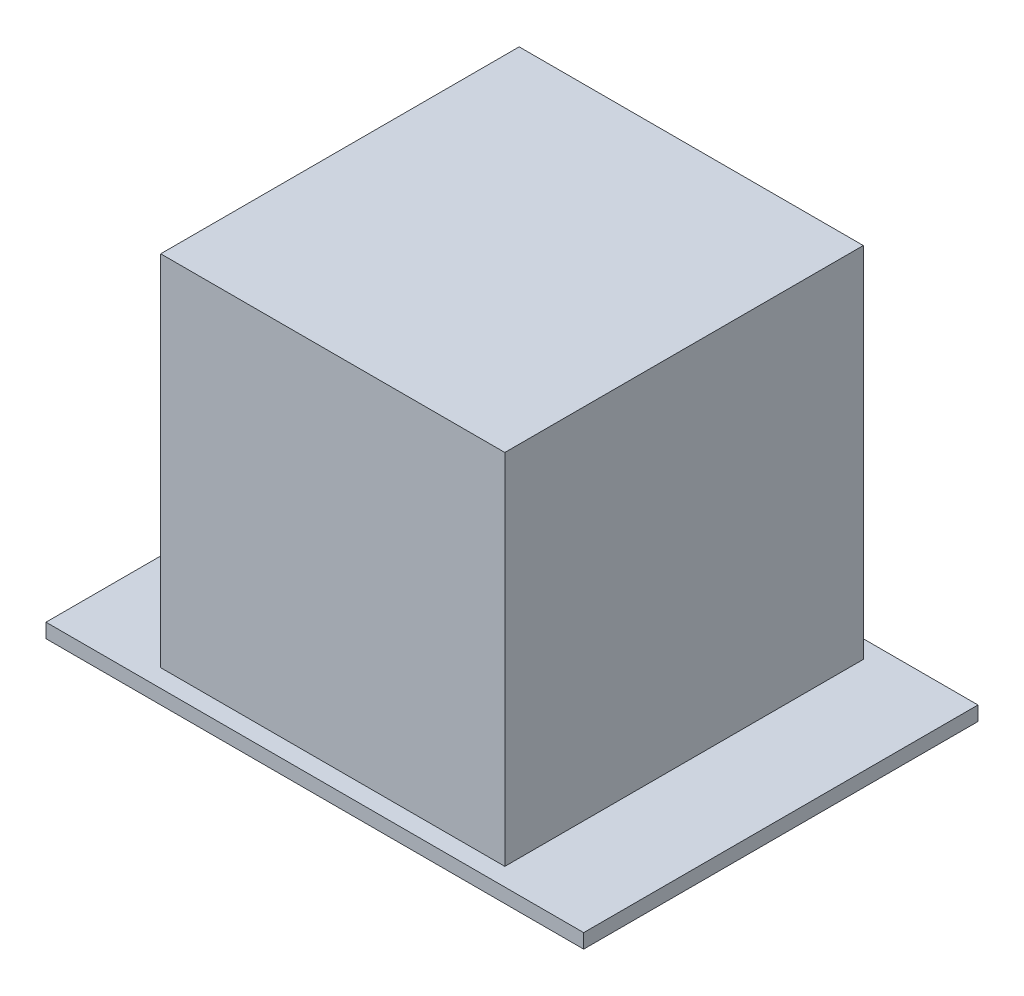
ISO-10303-21;
HEADER;
FILE_DESCRIPTION(('STEP AP214'),'2;1');
FILE_NAME('part.step','',(''),(''),'','','');
FILE_SCHEMA(('AUTOMOTIVE_DESIGN { 1 0 10303 214 1 1 1 1 }'));
ENDSEC;
DATA;
#1=APPLICATION_CONTEXT('core data for automotive mechanical design processes');
#2=APPLICATION_PROTOCOL_DEFINITION('international standard','automotive_design',2000,#1);
#3=PRODUCT_CONTEXT('',#1,'mechanical');
#4=PRODUCT('Part','Part','',(#3));
#5=PRODUCT_RELATED_PRODUCT_CATEGORY('part','',(#4));
#6=PRODUCT_DEFINITION_FORMATION('','',#4);
#7=PRODUCT_DEFINITION_CONTEXT('part definition',#1,'design');
#8=PRODUCT_DEFINITION('design','',#6,#7);
#9=PRODUCT_DEFINITION_SHAPE('','',#8);
#10=(LENGTH_UNIT() NAMED_UNIT(*) SI_UNIT(.MILLI.,.METRE.));
#11=(NAMED_UNIT(*) PLANE_ANGLE_UNIT() SI_UNIT($,.RADIAN.));
#12=(NAMED_UNIT(*) SI_UNIT($,.STERADIAN.) SOLID_ANGLE_UNIT());
#13=UNCERTAINTY_MEASURE_WITH_UNIT(LENGTH_MEASURE(1.E-05),#10,'distance_accuracy_value','');
#14=(GEOMETRIC_REPRESENTATION_CONTEXT(3) GLOBAL_UNCERTAINTY_ASSIGNED_CONTEXT((#13)) GLOBAL_UNIT_ASSIGNED_CONTEXT((#10,
#11,#12)) REPRESENTATION_CONTEXT('',''));
#15=CARTESIAN_POINT('',(0.,0.,0.));
#16=DIRECTION('',(0.,0.,1.));
#17=DIRECTION('',(1.,0.,0.));
#18=AXIS2_PLACEMENT_3D('',#15,#16,#17);
#19=CARTESIAN_POINT('',(0.,4.,0.));
#20=DIRECTION('',(0.,-1.,0.));
#21=DIRECTION('',(0.,0.,-1.));
#22=AXIS2_PLACEMENT_3D('',#19,#20,#21);
#23=PLANE('',#22);
#24=DIRECTION('',(0.,0.,1.));
#25=VECTOR('',#24,1.);
#26=CARTESIAN_POINT('',(0.,4.,0.));
#27=LINE('',#26,#25);
#28=CARTESIAN_POINT('',(0.,4.,-110.));
#29=VERTEX_POINT('',#28);
#30=CARTESIAN_POINT('',(0.,4.,0.));
#31=VERTEX_POINT('',#30);
#32=EDGE_CURVE('E131',#29,#31,#27,.T.);
#33=ORIENTED_EDGE('',*,*,#32,.T.);
#34=DIRECTION('',(1.,0.,0.));
#35=VECTOR('',#34,1.);
#36=CARTESIAN_POINT('',(0.,4.,0.));
#37=LINE('',#36,#35);
#38=CARTESIAN_POINT('',(150.,4.,0.));
#39=VERTEX_POINT('',#38);
#40=EDGE_CURVE('E134',#31,#39,#37,.T.);
#41=ORIENTED_EDGE('',*,*,#40,.T.);
#42=DIRECTION('',(0.,0.,-1.));
#43=VECTOR('',#42,1.);
#44=CARTESIAN_POINT('',(150.,4.,0.));
#45=LINE('',#44,#43);
#46=CARTESIAN_POINT('',(150.,4.,-110.));
#47=VERTEX_POINT('',#46);
#48=EDGE_CURVE('E137',#39,#47,#45,.T.);
#49=ORIENTED_EDGE('',*,*,#48,.T.);
#50=DIRECTION('',(-1.,0.,0.));
#51=VECTOR('',#50,1.);
#52=CARTESIAN_POINT('',(0.,4.,-110.));
#53=LINE('',#52,#51);
#54=EDGE_CURVE('E139',#47,#29,#53,.T.);
#55=ORIENTED_EDGE('',*,*,#54,.T.);
#56=EDGE_LOOP('',(#33,#41,#49,#55));
#57=FACE_BOUND('',#56,.T.);
#58=DIRECTION('',(0.,0.,1.));
#59=VECTOR('',#58,1.);
#60=CARTESIAN_POINT('',(27.,4.,-105.));
#61=LINE('',#60,#59);
#62=CARTESIAN_POINT('',(27.,4.,-105.));
#63=VERTEX_POINT('',#62);
#64=CARTESIAN_POINT('',(27.,4.,-5.));
#65=VERTEX_POINT('',#64);
#66=EDGE_CURVE('E52',#63,#65,#61,.T.);
#67=ORIENTED_EDGE('',*,*,#66,.F.);
#68=DIRECTION('',(-1.,0.,0.));
#69=VECTOR('',#68,1.);
#70=CARTESIAN_POINT('',(27.,4.,-105.));
#71=LINE('',#70,#69);
#72=CARTESIAN_POINT('',(123.,4.,-105.));
#73=VERTEX_POINT('',#72);
#74=EDGE_CURVE('E56',#73,#63,#71,.T.);
#75=ORIENTED_EDGE('',*,*,#74,.F.);
#76=DIRECTION('',(0.,0.,-1.));
#77=VECTOR('',#76,1.);
#78=CARTESIAN_POINT('',(123.,4.,-105.));
#79=LINE('',#78,#77);
#80=CARTESIAN_POINT('',(123.,4.,-5.));
#81=VERTEX_POINT('',#80);
#82=EDGE_CURVE('E286',#81,#73,#79,.T.);
#83=ORIENTED_EDGE('',*,*,#82,.F.);
#84=DIRECTION('',(1.,0.,0.));
#85=VECTOR('',#84,1.);
#86=CARTESIAN_POINT('',(27.,4.,-5.));
#87=LINE('',#86,#85);
#88=EDGE_CURVE('E292',#65,#81,#87,.T.);
#89=ORIENTED_EDGE('',*,*,#88,.F.);
#90=EDGE_LOOP('',(#67,#75,#83,#89));
#91=FACE_BOUND('',#90,.T.);
#92=ADVANCED_FACE('F37',(#57,#91),#23,.F.);
#93=CARTESIAN_POINT('',(0.,4.,0.));
#94=DIRECTION('',(1.,0.,0.));
#95=DIRECTION('',(0.,0.,-1.));
#96=AXIS2_PLACEMENT_3D('',#93,#94,#95);
#97=PLANE('',#96);
#98=DIRECTION('',(0.,0.,1.));
#99=VECTOR('',#98,1.);
#100=CARTESIAN_POINT('',(0.,0.,0.));
#101=LINE('',#100,#99);
#102=CARTESIAN_POINT('',(0.,0.,-110.));
#103=VERTEX_POINT('',#102);
#104=CARTESIAN_POINT('',(0.,0.,0.));
#105=VERTEX_POINT('',#104);
#106=EDGE_CURVE('E122',#103,#105,#101,.T.);
#107=ORIENTED_EDGE('',*,*,#106,.T.);
#108=DIRECTION('',(0.,-1.,0.));
#109=VECTOR('',#108,1.);
#110=CARTESIAN_POINT('',(0.,4.,0.));
#111=LINE('',#110,#109);
#112=EDGE_CURVE('E11',#31,#105,#111,.T.);
#113=ORIENTED_EDGE('',*,*,#112,.F.);
#114=ORIENTED_EDGE('',*,*,#32,.F.);
#115=DIRECTION('',(0.,-1.,0.));
#116=VECTOR('',#115,1.);
#117=CARTESIAN_POINT('',(0.,4.,-110.));
#118=LINE('',#117,#116);
#119=EDGE_CURVE('E140',#29,#103,#118,.T.);
#120=ORIENTED_EDGE('',*,*,#119,.T.);
#121=EDGE_LOOP('',(#107,#113,#114,#120));
#122=FACE_BOUND('',#121,.T.);
#123=ADVANCED_FACE('F39',(#122),#97,.F.);
#124=CARTESIAN_POINT('',(0.,4.,0.));
#125=DIRECTION('',(0.,0.,-1.));
#126=DIRECTION('',(-1.,0.,0.));
#127=AXIS2_PLACEMENT_3D('',#124,#125,#126);
#128=PLANE('',#127);
#129=DIRECTION('',(1.,0.,0.));
#130=VECTOR('',#129,1.);
#131=CARTESIAN_POINT('',(0.,0.,0.));
#132=LINE('',#131,#130);
#133=CARTESIAN_POINT('',(150.,0.,0.));
#134=VERTEX_POINT('',#133);
#135=EDGE_CURVE('E125',#105,#134,#132,.T.);
#136=ORIENTED_EDGE('',*,*,#135,.T.);
#137=DIRECTION('',(0.,-1.,0.));
#138=VECTOR('',#137,1.);
#139=CARTESIAN_POINT('',(150.,4.,0.));
#140=LINE('',#139,#138);
#141=EDGE_CURVE('E45',#39,#134,#140,.T.);
#142=ORIENTED_EDGE('',*,*,#141,.F.);
#143=ORIENTED_EDGE('',*,*,#40,.F.);
#144=ORIENTED_EDGE('',*,*,#112,.T.);
#145=EDGE_LOOP('',(#136,#142,#143,#144));
#146=FACE_BOUND('',#145,.T.);
#147=ADVANCED_FACE('F170',(#146),#128,.F.);
#148=CARTESIAN_POINT('',(150.,4.,0.));
#149=DIRECTION('',(-1.,0.,0.));
#150=DIRECTION('',(0.,0.,1.));
#151=AXIS2_PLACEMENT_3D('',#148,#149,#150);
#152=PLANE('',#151);
#153=DIRECTION('',(0.,0.,-1.));
#154=VECTOR('',#153,1.);
#155=CARTESIAN_POINT('',(150.,0.,0.));
#156=LINE('',#155,#154);
#157=CARTESIAN_POINT('',(150.,0.,-110.));
#158=VERTEX_POINT('',#157);
#159=EDGE_CURVE('E143',#134,#158,#156,.T.);
#160=ORIENTED_EDGE('',*,*,#159,.T.);
#161=DIRECTION('',(0.,-1.,0.));
#162=VECTOR('',#161,1.);
#163=CARTESIAN_POINT('',(150.,4.,-110.));
#164=LINE('',#163,#162);
#165=EDGE_CURVE('E148',#47,#158,#164,.T.);
#166=ORIENTED_EDGE('',*,*,#165,.F.);
#167=ORIENTED_EDGE('',*,*,#48,.F.);
#168=ORIENTED_EDGE('',*,*,#141,.T.);
#169=EDGE_LOOP('',(#160,#166,#167,#168));
#170=FACE_BOUND('',#169,.T.);
#171=ADVANCED_FACE('F155',(#170),#152,.F.);
#172=CARTESIAN_POINT('',(0.,4.,-110.));
#173=DIRECTION('',(0.,0.,1.));
#174=DIRECTION('',(1.,0.,0.));
#175=AXIS2_PLACEMENT_3D('',#172,#173,#174);
#176=PLANE('',#175);
#177=DIRECTION('',(-1.,0.,0.));
#178=VECTOR('',#177,1.);
#179=CARTESIAN_POINT('',(0.,0.,-110.));
#180=LINE('',#179,#178);
#181=EDGE_CURVE('E135',#158,#103,#180,.T.);
#182=ORIENTED_EDGE('',*,*,#181,.T.);
#183=ORIENTED_EDGE('',*,*,#119,.F.);
#184=ORIENTED_EDGE('',*,*,#54,.F.);
#185=ORIENTED_EDGE('',*,*,#165,.T.);
#186=EDGE_LOOP('',(#182,#183,#184,#185));
#187=FACE_BOUND('',#186,.T.);
#188=ADVANCED_FACE('F164',(#187),#176,.F.);
#189=CARTESIAN_POINT('',(0.,0.,0.));
#190=DIRECTION('',(0.,-1.,0.));
#191=DIRECTION('',(0.,0.,-1.));
#192=AXIS2_PLACEMENT_3D('',#189,#190,#191);
#193=PLANE('',#192);
#194=ORIENTED_EDGE('',*,*,#106,.F.);
#195=ORIENTED_EDGE('',*,*,#181,.F.);
#196=ORIENTED_EDGE('',*,*,#159,.F.);
#197=ORIENTED_EDGE('',*,*,#135,.F.);
#198=EDGE_LOOP('',(#194,#195,#196,#197));
#199=FACE_BOUND('',#198,.T.);
#200=ADVANCED_FACE('F161',(#199),#193,.T.);
#201=CARTESIAN_POINT('',(27.,104.,-105.));
#202=DIRECTION('',(1.,0.,0.));
#203=DIRECTION('',(0.,0.,-1.));
#204=AXIS2_PLACEMENT_3D('',#201,#202,#203);
#205=PLANE('',#204);
#206=ORIENTED_EDGE('',*,*,#66,.T.);
#207=DIRECTION('',(0.,-1.,0.));
#208=VECTOR('',#207,1.);
#209=CARTESIAN_POINT('',(27.,104.,-5.));
#210=LINE('',#209,#208);
#211=CARTESIAN_POINT('',(27.,104.,-5.));
#212=VERTEX_POINT('',#211);
#213=EDGE_CURVE('E105',#212,#65,#210,.T.);
#214=ORIENTED_EDGE('',*,*,#213,.F.);
#215=DIRECTION('',(0.,0.,1.));
#216=VECTOR('',#215,1.);
#217=CARTESIAN_POINT('',(27.,104.,-105.));
#218=LINE('',#217,#216);
#219=CARTESIAN_POINT('',(27.,104.,-105.));
#220=VERTEX_POINT('',#219);
#221=EDGE_CURVE('E111',#220,#212,#218,.T.);
#222=ORIENTED_EDGE('',*,*,#221,.F.);
#223=DIRECTION('',(0.,-1.,0.));
#224=VECTOR('',#223,1.);
#225=CARTESIAN_POINT('',(27.,104.,-105.));
#226=LINE('',#225,#224);
#227=EDGE_CURVE('E284',#220,#63,#226,.T.);
#228=ORIENTED_EDGE('',*,*,#227,.T.);
#229=EDGE_LOOP('',(#206,#214,#222,#228));
#230=FACE_BOUND('',#229,.T.);
#231=ADVANCED_FACE('F121',(#230),#205,.F.);
#232=CARTESIAN_POINT('',(27.,104.,-5.));
#233=DIRECTION('',(0.,0.,-1.));
#234=DIRECTION('',(-1.,0.,0.));
#235=AXIS2_PLACEMENT_3D('',#232,#233,#234);
#236=PLANE('',#235);
#237=ORIENTED_EDGE('',*,*,#88,.T.);
#238=DIRECTION('',(0.,-1.,0.));
#239=VECTOR('',#238,1.);
#240=CARTESIAN_POINT('',(123.,104.,-5.));
#241=LINE('',#240,#239);
#242=CARTESIAN_POINT('',(123.,104.,-5.));
#243=VERTEX_POINT('',#242);
#244=EDGE_CURVE('E107',#243,#81,#241,.T.);
#245=ORIENTED_EDGE('',*,*,#244,.F.);
#246=DIRECTION('',(1.,0.,0.));
#247=VECTOR('',#246,1.);
#248=CARTESIAN_POINT('',(27.,104.,-5.));
#249=LINE('',#248,#247);
#250=EDGE_CURVE('E100',#212,#243,#249,.T.);
#251=ORIENTED_EDGE('',*,*,#250,.F.);
#252=ORIENTED_EDGE('',*,*,#213,.T.);
#253=EDGE_LOOP('',(#237,#245,#251,#252));
#254=FACE_BOUND('',#253,.T.);
#255=ADVANCED_FACE('F103',(#254),#236,.F.);
#256=CARTESIAN_POINT('',(123.,104.,-105.));
#257=DIRECTION('',(-1.,0.,0.));
#258=DIRECTION('',(0.,0.,1.));
#259=AXIS2_PLACEMENT_3D('',#256,#257,#258);
#260=PLANE('',#259);
#261=ORIENTED_EDGE('',*,*,#82,.T.);
#262=DIRECTION('',(0.,-1.,0.));
#263=VECTOR('',#262,1.);
#264=CARTESIAN_POINT('',(123.,104.,-105.));
#265=LINE('',#264,#263);
#266=CARTESIAN_POINT('',(123.,104.,-105.));
#267=VERTEX_POINT('',#266);
#268=EDGE_CURVE('E127',#267,#73,#265,.T.);
#269=ORIENTED_EDGE('',*,*,#268,.F.);
#270=DIRECTION('',(0.,0.,-1.));
#271=VECTOR('',#270,1.);
#272=CARTESIAN_POINT('',(123.,104.,-105.));
#273=LINE('',#272,#271);
#274=EDGE_CURVE('E110',#243,#267,#273,.T.);
#275=ORIENTED_EDGE('',*,*,#274,.F.);
#276=ORIENTED_EDGE('',*,*,#244,.T.);
#277=EDGE_LOOP('',(#261,#269,#275,#276));
#278=FACE_BOUND('',#277,.T.);
#279=ADVANCED_FACE('F206',(#278),#260,.F.);
#280=CARTESIAN_POINT('',(27.,104.,-105.));
#281=DIRECTION('',(0.,0.,1.));
#282=DIRECTION('',(1.,0.,0.));
#283=AXIS2_PLACEMENT_3D('',#280,#281,#282);
#284=PLANE('',#283);
#285=ORIENTED_EDGE('',*,*,#74,.T.);
#286=ORIENTED_EDGE('',*,*,#227,.F.);
#287=DIRECTION('',(-1.,0.,0.));
#288=VECTOR('',#287,1.);
#289=CARTESIAN_POINT('',(27.,104.,-105.));
#290=LINE('',#289,#288);
#291=EDGE_CURVE('E116',#267,#220,#290,.T.);
#292=ORIENTED_EDGE('',*,*,#291,.F.);
#293=ORIENTED_EDGE('',*,*,#268,.T.);
#294=EDGE_LOOP('',(#285,#286,#292,#293));
#295=FACE_BOUND('',#294,.T.);
#296=ADVANCED_FACE('F212',(#295),#284,.F.);
#297=CARTESIAN_POINT('',(0.,104.,0.));
#298=DIRECTION('',(0.,1.,0.));
#299=DIRECTION('',(0.,0.,1.));
#300=AXIS2_PLACEMENT_3D('',#297,#298,#299);
#301=PLANE('',#300);
#302=ORIENTED_EDGE('',*,*,#221,.T.);
#303=ORIENTED_EDGE('',*,*,#250,.T.);
#304=ORIENTED_EDGE('',*,*,#274,.T.);
#305=ORIENTED_EDGE('',*,*,#291,.T.);
#306=EDGE_LOOP('',(#302,#303,#304,#305));
#307=FACE_BOUND('',#306,.T.);
#308=ADVANCED_FACE('F114',(#307),#301,.T.);
#309=CLOSED_SHELL('',(#92,#123,#147,#171,#188,#200,#231,#255,#279,#296,#308));
#310=MANIFOLD_SOLID_BREP('B2',#309);
#311=ADVANCED_BREP_SHAPE_REPRESENTATION('',(#18,#310),#14);
#312=SHAPE_DEFINITION_REPRESENTATION(#9,#311);
ENDSEC;
END-ISO-10303-21;
